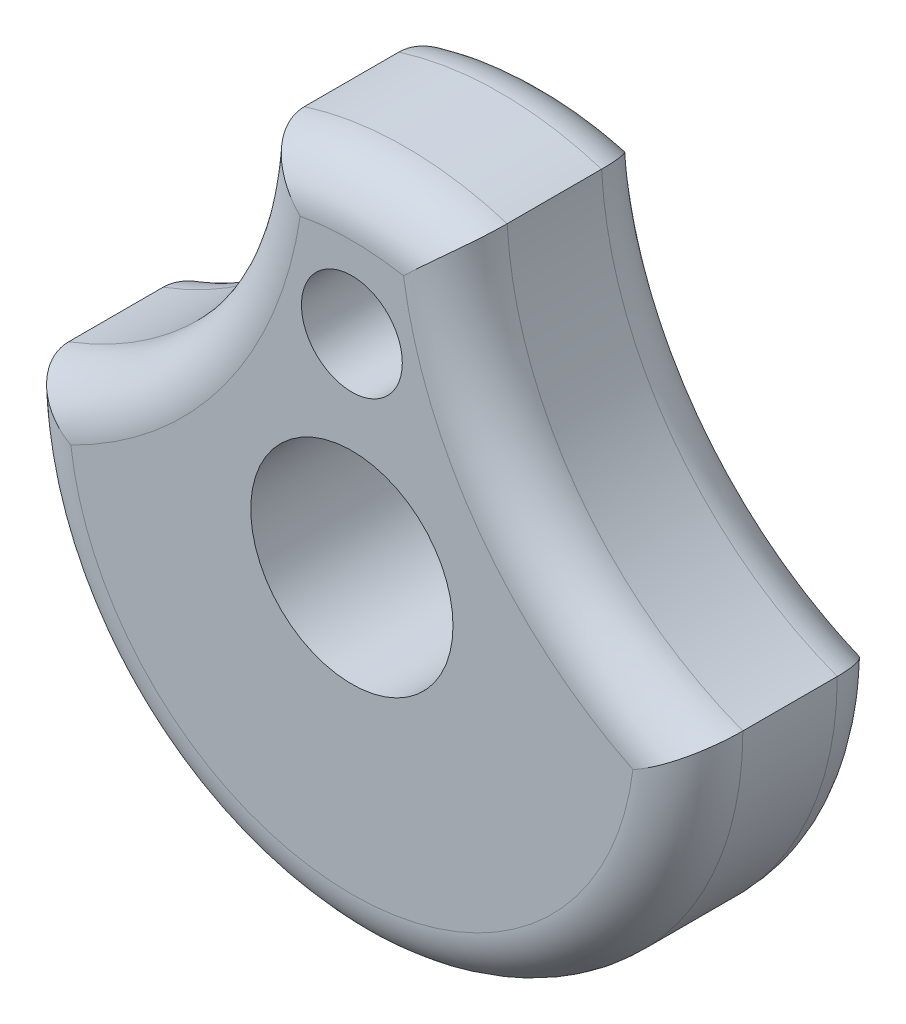
ISO-10303-21;
HEADER;
FILE_DESCRIPTION(('STEP AP214'),'2;1');
FILE_NAME('part.step','',(''),(''),'','','');
FILE_SCHEMA(('AUTOMOTIVE_DESIGN { 1 0 10303 214 1 1 1 1 }'));
ENDSEC;
DATA;
#1=APPLICATION_CONTEXT('core data for automotive mechanical design processes');
#2=APPLICATION_PROTOCOL_DEFINITION('international standard','automotive_design',2000,#1);
#3=PRODUCT_CONTEXT('',#1,'mechanical');
#4=PRODUCT('Part','Part','',(#3));
#5=PRODUCT_RELATED_PRODUCT_CATEGORY('part','',(#4));
#6=PRODUCT_DEFINITION_FORMATION('','',#4);
#7=PRODUCT_DEFINITION_CONTEXT('part definition',#1,'design');
#8=PRODUCT_DEFINITION('design','',#6,#7);
#9=PRODUCT_DEFINITION_SHAPE('','',#8);
#10=(LENGTH_UNIT() NAMED_UNIT(*) SI_UNIT(.MILLI.,.METRE.));
#11=(NAMED_UNIT(*) PLANE_ANGLE_UNIT() SI_UNIT($,.RADIAN.));
#12=(NAMED_UNIT(*) SI_UNIT($,.STERADIAN.) SOLID_ANGLE_UNIT());
#13=UNCERTAINTY_MEASURE_WITH_UNIT(LENGTH_MEASURE(1.E-05),#10,'distance_accuracy_value','');
#14=(GEOMETRIC_REPRESENTATION_CONTEXT(3) GLOBAL_UNCERTAINTY_ASSIGNED_CONTEXT((#13)) GLOBAL_UNIT_ASSIGNED_CONTEXT((#10,
#11,#12)) REPRESENTATION_CONTEXT('',''));
#15=CARTESIAN_POINT('',(0.,0.,0.));
#16=DIRECTION('',(0.,0.,1.));
#17=DIRECTION('',(1.,0.,0.));
#18=AXIS2_PLACEMENT_3D('',#15,#16,#17);
#19=CARTESIAN_POINT('',(0.,0.,-9.525));
#20=DIRECTION('',(0.,0.,1.));
#21=DIRECTION('',(1.,0.,0.));
#22=AXIS2_PLACEMENT_3D('',#19,#20,#21);
#23=CYLINDRICAL_SURFACE('',#22,15.875);
#24=DIRECTION('',(0.,0.,1.));
#25=VECTOR('',#24,1.);
#26=CARTESIAN_POINT('',(-15.875,0.,-9.525));
#27=LINE('',#26,#25);
#28=CARTESIAN_POINT('',(-15.875,0.,-6.985));
#29=VERTEX_POINT('',#28);
#30=CARTESIAN_POINT('',(-15.875,0.,-2.54));
#31=VERTEX_POINT('',#30);
#32=EDGE_CURVE('E280',#29,#31,#27,.T.);
#33=ORIENTED_EDGE('',*,*,#32,.F.);
#34=CARTESIAN_POINT('',(0.,0.,-6.985));
#35=DIRECTION('',(0.,0.,1.));
#36=DIRECTION('',(1.,0.,0.));
#37=AXIS2_PLACEMENT_3D('',#34,#35,#36);
#38=CIRCLE('',#37,15.875);
#39=CARTESIAN_POINT('',(15.875,0.,-6.985));
#40=VERTEX_POINT('',#39);
#41=EDGE_CURVE('E57',#29,#40,#38,.T.);
#42=ORIENTED_EDGE('',*,*,#41,.T.);
#43=DIRECTION('',(0.,0.,1.));
#44=VECTOR('',#43,1.);
#45=CARTESIAN_POINT('',(15.875,0.,-9.525));
#46=LINE('',#45,#44);
#47=CARTESIAN_POINT('',(15.875,0.,-2.54));
#48=VERTEX_POINT('',#47);
#49=EDGE_CURVE('E114',#40,#48,#46,.T.);
#50=ORIENTED_EDGE('',*,*,#49,.T.);
#51=CARTESIAN_POINT('',(0.,0.,-2.54));
#52=DIRECTION('',(0.,0.,1.));
#53=DIRECTION('',(1.,0.,0.));
#54=AXIS2_PLACEMENT_3D('',#51,#52,#53);
#55=CIRCLE('',#54,15.875);
#56=EDGE_CURVE('E117',#48,#31,#55,.F.);
#57=ORIENTED_EDGE('',*,*,#56,.T.);
#58=EDGE_LOOP('',(#33,#42,#50,#57));
#59=FACE_BOUND('',#58,.T.);
#60=ADVANCED_FACE('F42',(#59),#23,.T.);
#61=DIRECTION('',(0.,0.,1.));
#62=VECTOR('',#61,1.);
#63=CARTESIAN_POINT('',(4.7752,15.1397850037575,-9.525));
#64=LINE('',#63,#62);
#65=CARTESIAN_POINT('',(4.7752,15.1397850037575,-6.985));
#66=VERTEX_POINT('',#65);
#67=CARTESIAN_POINT('',(4.7752,15.1397850037575,-2.54));
#68=VERTEX_POINT('',#67);
#69=EDGE_CURVE('E125',#66,#68,#64,.T.);
#70=ORIENTED_EDGE('',*,*,#69,.F.);
#71=CARTESIAN_POINT('',(0.,0.,-6.985));
#72=DIRECTION('',(0.,0.,1.));
#73=DIRECTION('',(1.,0.,0.));
#74=AXIS2_PLACEMENT_3D('',#71,#72,#73);
#75=CIRCLE('',#74,15.875);
#76=CARTESIAN_POINT('',(-4.7752,15.1397850037575,-6.985));
#77=VERTEX_POINT('',#76);
#78=EDGE_CURVE('E71',#66,#77,#75,.T.);
#79=ORIENTED_EDGE('',*,*,#78,.T.);
#80=DIRECTION('',(0.,0.,1.));
#81=VECTOR('',#80,1.);
#82=CARTESIAN_POINT('',(-4.7752,15.1397850037575,-9.525));
#83=LINE('',#82,#81);
#84=CARTESIAN_POINT('',(-4.7752,15.1397850037575,-2.54));
#85=VERTEX_POINT('',#84);
#86=EDGE_CURVE('E283',#77,#85,#83,.T.);
#87=ORIENTED_EDGE('',*,*,#86,.T.);
#88=CARTESIAN_POINT('',(0.,0.,-2.54));
#89=DIRECTION('',(0.,0.,1.));
#90=DIRECTION('',(1.,0.,0.));
#91=AXIS2_PLACEMENT_3D('',#88,#89,#90);
#92=CIRCLE('',#91,15.875);
#93=EDGE_CURVE('E147',#85,#68,#92,.F.);
#94=ORIENTED_EDGE('',*,*,#93,.T.);
#95=EDGE_LOOP('',(#70,#79,#87,#94));
#96=FACE_BOUND('',#95,.T.);
#97=ADVANCED_FACE('F276',(#96),#23,.T.);
#98=CARTESIAN_POINT('',(0.,0.,-9.525));
#99=DIRECTION('',(0.,0.,1.));
#100=DIRECTION('',(1.,0.,0.));
#101=AXIS2_PLACEMENT_3D('',#98,#99,#100);
#102=PLANE('',#101);
#103=CARTESIAN_POINT('',(0.,0.,-9.525));
#104=DIRECTION('',(0.,0.,1.));
#105=DIRECTION('',(1.,0.,0.));
#106=AXIS2_PLACEMENT_3D('',#103,#104,#105);
#107=CIRCLE('',#106,13.335);
#108=CARTESIAN_POINT('',(-2.43189825374815,13.1113727688376,-9.525));
#109=VERTEX_POINT('',#108);
#110=CARTESIAN_POINT('',(2.43189825374815,13.1113727688376,-9.525));
#111=VERTEX_POINT('',#110);
#112=EDGE_CURVE('E221',#109,#111,#107,.F.);
#113=ORIENTED_EDGE('',*,*,#112,.T.);
#114=CARTESIAN_POINT('',(21.8958594465532,16.0530457086763,-9.525));
#115=DIRECTION('',(0.,0.,1.));
#116=DIRECTION('',(1.,0.,0.));
#117=AXIS2_PLACEMENT_3D('',#114,#115,#116);
#118=CIRCLE('',#117,19.685);
#119=CARTESIAN_POINT('',(13.2356639600391,-1.62463058475547,-9.525));
#120=VERTEX_POINT('',#119);
#121=EDGE_CURVE('E224',#111,#120,#118,.T.);
#122=ORIENTED_EDGE('',*,*,#121,.T.);
#123=CARTESIAN_POINT('',(0.,0.,-9.525));
#124=DIRECTION('',(0.,0.,1.));
#125=DIRECTION('',(1.,0.,0.));
#126=AXIS2_PLACEMENT_3D('',#123,#124,#125);
#127=CIRCLE('',#126,13.335);
#128=CARTESIAN_POINT('',(-13.2356639600391,-1.62463058475547,-9.525));
#129=VERTEX_POINT('',#128);
#130=EDGE_CURVE('E218',#120,#129,#127,.F.);
#131=ORIENTED_EDGE('',*,*,#130,.T.);
#132=CARTESIAN_POINT('',(-21.8958594465532,16.0530457086763,-9.525));
#133=DIRECTION('',(0.,0.,1.));
#134=DIRECTION('',(1.,0.,0.));
#135=AXIS2_PLACEMENT_3D('',#132,#133,#134);
#136=CIRCLE('',#135,19.685);
#137=EDGE_CURVE('E176',#129,#109,#136,.T.);
#138=ORIENTED_EDGE('',*,*,#137,.T.);
#139=EDGE_LOOP('',(#113,#122,#131,#138));
#140=FACE_BOUND('',#139,.T.);
#141=CARTESIAN_POINT('',(0.,9.525,-9.525));
#142=DIRECTION('',(0.,0.,1.));
#143=DIRECTION('',(1.,0.,0.));
#144=AXIS2_PLACEMENT_3D('',#141,#142,#143);
#145=CIRCLE('',#144,2.3749);
#146=CARTESIAN_POINT('',(2.3749,9.525,-9.525));
#147=VERTEX_POINT('',#146);
#148=EDGE_CURVE('E287',#147,#147,#145,.T.);
#149=ORIENTED_EDGE('',*,*,#148,.T.);
#150=EDGE_LOOP('',(#149));
#151=FACE_BOUND('',#150,.T.);
#152=CARTESIAN_POINT('',(0.,0.,-9.525));
#153=DIRECTION('',(0.,0.,1.));
#154=DIRECTION('',(1.,0.,0.));
#155=AXIS2_PLACEMENT_3D('',#152,#153,#154);
#156=CIRCLE('',#155,4.7625);
#157=CARTESIAN_POINT('',(4.7625,0.,-9.525));
#158=VERTEX_POINT('',#157);
#159=EDGE_CURVE('E153',#158,#158,#156,.T.);
#160=ORIENTED_EDGE('',*,*,#159,.T.);
#161=EDGE_LOOP('',(#160));
#162=FACE_BOUND('',#161,.T.);
#163=ADVANCED_FACE('F309',(#140,#151,#162),#102,.F.);
#164=CARTESIAN_POINT('',(0.,0.,0.));
#165=DIRECTION('',(0.,0.,1.));
#166=DIRECTION('',(1.,0.,0.));
#167=AXIS2_PLACEMENT_3D('',#164,#165,#166);
#168=PLANE('',#167);
#169=CARTESIAN_POINT('',(0.,0.,0.));
#170=DIRECTION('',(0.,0.,1.));
#171=DIRECTION('',(1.,0.,0.));
#172=AXIS2_PLACEMENT_3D('',#169,#170,#171);
#173=CIRCLE('',#172,13.335);
#174=CARTESIAN_POINT('',(-13.2356639600391,-1.62463058475547,0.));
#175=VERTEX_POINT('',#174);
#176=CARTESIAN_POINT('',(13.2356639600391,-1.62463058475547,0.));
#177=VERTEX_POINT('',#176);
#178=EDGE_CURVE('E166',#175,#177,#173,.T.);
#179=ORIENTED_EDGE('',*,*,#178,.T.);
#180=CARTESIAN_POINT('',(21.8958594465532,16.0530457086763,0.));
#181=DIRECTION('',(0.,0.,1.));
#182=DIRECTION('',(1.,0.,0.));
#183=AXIS2_PLACEMENT_3D('',#180,#181,#182);
#184=CIRCLE('',#183,19.685);
#185=CARTESIAN_POINT('',(2.43189825374815,13.1113727688376,0.));
#186=VERTEX_POINT('',#185);
#187=EDGE_CURVE('E136',#177,#186,#184,.F.);
#188=ORIENTED_EDGE('',*,*,#187,.T.);
#189=CARTESIAN_POINT('',(0.,0.,0.));
#190=DIRECTION('',(0.,0.,1.));
#191=DIRECTION('',(1.,0.,0.));
#192=AXIS2_PLACEMENT_3D('',#189,#190,#191);
#193=CIRCLE('',#192,13.335);
#194=CARTESIAN_POINT('',(-2.43189825374815,13.1113727688376,0.));
#195=VERTEX_POINT('',#194);
#196=EDGE_CURVE('E157',#186,#195,#193,.T.);
#197=ORIENTED_EDGE('',*,*,#196,.T.);
#198=CARTESIAN_POINT('',(-21.8958594465532,16.0530457086763,0.));
#199=DIRECTION('',(0.,0.,1.));
#200=DIRECTION('',(1.,0.,0.));
#201=AXIS2_PLACEMENT_3D('',#198,#199,#200);
#202=CIRCLE('',#201,19.685);
#203=EDGE_CURVE('E152',#195,#175,#202,.F.);
#204=ORIENTED_EDGE('',*,*,#203,.T.);
#205=EDGE_LOOP('',(#179,#188,#197,#204));
#206=FACE_BOUND('',#205,.T.);
#207=CARTESIAN_POINT('',(0.,9.525,0.));
#208=DIRECTION('',(0.,0.,1.));
#209=DIRECTION('',(1.,0.,0.));
#210=AXIS2_PLACEMENT_3D('',#207,#208,#209);
#211=CIRCLE('',#210,2.3749);
#212=CARTESIAN_POINT('',(2.3749,9.525,0.));
#213=VERTEX_POINT('',#212);
#214=EDGE_CURVE('E291',#213,#213,#211,.T.);
#215=ORIENTED_EDGE('',*,*,#214,.F.);
#216=EDGE_LOOP('',(#215));
#217=FACE_BOUND('',#216,.T.);
#218=CARTESIAN_POINT('',(0.,0.,0.));
#219=DIRECTION('',(0.,0.,1.));
#220=DIRECTION('',(1.,0.,0.));
#221=AXIS2_PLACEMENT_3D('',#218,#219,#220);
#222=CIRCLE('',#221,4.7625);
#223=CARTESIAN_POINT('',(4.7625,0.,0.));
#224=VERTEX_POINT('',#223);
#225=EDGE_CURVE('E160',#224,#224,#222,.T.);
#226=ORIENTED_EDGE('',*,*,#225,.F.);
#227=EDGE_LOOP('',(#226));
#228=FACE_BOUND('',#227,.T.);
#229=ADVANCED_FACE('F305',(#206,#217,#228),#168,.T.);
#230=CARTESIAN_POINT('',(0.,0.,-9.525));
#231=DIRECTION('',(0.,0.,1.));
#232=DIRECTION('',(1.,0.,0.));
#233=AXIS2_PLACEMENT_3D('',#230,#231,#232);
#234=CYLINDRICAL_SURFACE('',#233,4.7625);
#235=ORIENTED_EDGE('',*,*,#159,.F.);
#236=EDGE_LOOP('',(#235));
#237=FACE_BOUND('',#236,.T.);
#238=ORIENTED_EDGE('',*,*,#225,.T.);
#239=EDGE_LOOP('',(#238));
#240=FACE_BOUND('',#239,.T.);
#241=ADVANCED_FACE('F308',(#237,#240),#234,.F.);
#242=CARTESIAN_POINT('',(0.,9.525,-9.525));
#243=DIRECTION('',(0.,0.,1.));
#244=DIRECTION('',(1.,0.,0.));
#245=AXIS2_PLACEMENT_3D('',#242,#243,#244);
#246=CYLINDRICAL_SURFACE('',#245,2.3749);
#247=ORIENTED_EDGE('',*,*,#148,.F.);
#248=EDGE_LOOP('',(#247));
#249=FACE_BOUND('',#248,.T.);
#250=ORIENTED_EDGE('',*,*,#214,.T.);
#251=EDGE_LOOP('',(#250));
#252=FACE_BOUND('',#251,.T.);
#253=ADVANCED_FACE('F317',(#249,#252),#246,.F.);
#254=CARTESIAN_POINT('',(21.8958594465532,16.0530457086763,-9.525));
#255=DIRECTION('',(0.,0.,1.));
#256=DIRECTION('',(1.,0.,0.));
#257=AXIS2_PLACEMENT_3D('',#254,#255,#256);
#258=CYLINDRICAL_SURFACE('',#257,17.145);
#259=ORIENTED_EDGE('',*,*,#49,.F.);
#260=CARTESIAN_POINT('',(21.8958594465532,16.0530457086763,-6.985));
#261=DIRECTION('',(0.,0.,1.));
#262=DIRECTION('',(1.,0.,0.));
#263=AXIS2_PLACEMENT_3D('',#260,#261,#262);
#264=CIRCLE('',#263,17.145);
#265=EDGE_CURVE('E228',#40,#66,#264,.F.);
#266=ORIENTED_EDGE('',*,*,#265,.T.);
#267=ORIENTED_EDGE('',*,*,#69,.T.);
#268=CARTESIAN_POINT('',(21.8958594465532,16.0530457086763,-2.54));
#269=DIRECTION('',(0.,0.,1.));
#270=DIRECTION('',(1.,0.,0.));
#271=AXIS2_PLACEMENT_3D('',#268,#269,#270);
#272=CIRCLE('',#271,17.145);
#273=EDGE_CURVE('E134',#68,#48,#272,.T.);
#274=ORIENTED_EDGE('',*,*,#273,.T.);
#275=EDGE_LOOP('',(#259,#266,#267,#274));
#276=FACE_BOUND('',#275,.T.);
#277=ADVANCED_FACE('F149',(#276),#258,.F.);
#278=CARTESIAN_POINT('',(-21.8958594465532,16.0530457086763,-9.525));
#279=DIRECTION('',(0.,0.,1.));
#280=DIRECTION('',(1.,0.,0.));
#281=AXIS2_PLACEMENT_3D('',#278,#279,#280);
#282=CYLINDRICAL_SURFACE('',#281,17.145);
#283=ORIENTED_EDGE('',*,*,#86,.F.);
#284=CARTESIAN_POINT('',(-21.8958594465532,16.0530457086763,-6.985));
#285=DIRECTION('',(0.,0.,1.));
#286=DIRECTION('',(1.,0.,0.));
#287=AXIS2_PLACEMENT_3D('',#284,#285,#286);
#288=CIRCLE('',#287,17.145);
#289=EDGE_CURVE('E11',#77,#29,#288,.F.);
#290=ORIENTED_EDGE('',*,*,#289,.T.);
#291=ORIENTED_EDGE('',*,*,#32,.T.);
#292=CARTESIAN_POINT('',(-21.8958594465532,16.0530457086763,-2.54));
#293=DIRECTION('',(0.,0.,1.));
#294=DIRECTION('',(1.,0.,0.));
#295=AXIS2_PLACEMENT_3D('',#292,#293,#294);
#296=CIRCLE('',#295,17.145);
#297=EDGE_CURVE('E173',#31,#85,#296,.T.);
#298=ORIENTED_EDGE('',*,*,#297,.T.);
#299=EDGE_LOOP('',(#283,#290,#291,#298));
#300=FACE_BOUND('',#299,.T.);
#301=ADVANCED_FACE('F298',(#300),#282,.F.);
#302=CARTESIAN_POINT('',(-21.8958594465532,16.0530457086763,-2.54));
#303=DIRECTION('',(0.,0.,1.));
#304=DIRECTION('',(1.,0.,0.));
#305=AXIS2_PLACEMENT_3D('',#302,#303,#304);
#306=TOROIDAL_SURFACE('',#305,19.685,2.54);
#307=CARTESIAN_POINT('',(-15.875,0.,-2.54));
#308=CARTESIAN_POINT('',(-15.875011035577,9.67959000808573E-06,-2.47759961717362));
#309=CARTESIAN_POINT('',(-15.8727008346527,-0.00159318558438933,-2.41520663359023));
#310=CARTESIAN_POINT('',(-15.8635228750597,-0.00795030003033197,-2.2909447341386));
#311=CARTESIAN_POINT('',(-15.8566570949852,-0.0127031811754103,-2.22907560255861));
#312=CARTESIAN_POINT('',(-15.8385007064541,-0.0252535953934955,-2.10663901437687));
#313=CARTESIAN_POINT('',(-15.8272335980759,-0.0330349576523916,-2.04606641759837));
#314=CARTESIAN_POINT('',(-15.8004381508091,-0.0515014095663261,-1.92633680777353));
#315=CARTESIAN_POINT('',(-15.7849095385524,-0.0621866855020355,-1.86717988580507));
#316=CARTESIAN_POINT('',(-15.7322577345783,-0.0983216521184355,-1.69260133535844));
#317=CARTESIAN_POINT('',(-15.6890259649945,-0.127880232507952,-1.5797916344026));
#318=CARTESIAN_POINT('',(-15.5882204997024,-0.196264861280495,-1.36380940125554));
#319=CARTESIAN_POINT('',(-15.5306305497572,-0.235101410729569,-1.26064797469283));
#320=CARTESIAN_POINT('',(-15.3991471421842,-0.322927609033043,-1.05930839542953));
#321=CARTESIAN_POINT('',(-15.3244439601645,-0.372409251009303,-0.961876190769851));
#322=CARTESIAN_POINT('',(-15.1636978435424,-0.477639380240903,-0.780822697685214));
#323=CARTESIAN_POINT('',(-15.0776521215094,-0.533389407455929,-0.697204815550572));
#324=CARTESIAN_POINT('',(-14.8812137302948,-0.659010288492005,-0.531358188800642));
#325=CARTESIAN_POINT('',(-14.7691572702479,-0.729682038155604,-0.451709457340281));
#326=CARTESIAN_POINT('',(-14.5355306996401,-0.87456949576647,-0.311847428051249));
#327=CARTESIAN_POINT('',(-14.4139501545962,-0.948789054964353,-0.251655827929376));
#328=CARTESIAN_POINT('',(-14.1418783286326,-1.11191316952271,-0.141661073413214));
#329=CARTESIAN_POINT('',(-13.9900657786484,-1.20110248357548,-0.0955529204188953));
#330=CARTESIAN_POINT('',(-13.6807515386827,-1.37876922311312,-0.0296357961396635));
#331=CARTESIAN_POINT('',(-13.5232594944408,-1.46724756990187,-0.00978421040848305));
#332=CARTESIAN_POINT('',(-13.3247587879194,-1.57618451291468,-0.00107266417256496));
#333=CARTESIAN_POINT('',(-13.2847983165469,-1.59798530516189,-0.000137359961281783));
#334=CARTESIAN_POINT('',(-13.2417415733669,-1.62133667929731,-4.68443420540658E-06));
#335=CARTESIAN_POINT('',(-13.2387029309582,-1.62298391364793,-2.68338397828118E-09));
#336=CARTESIAN_POINT('',(-13.2356639600391,-1.62463058475547,0.));
#337=B_SPLINE_CURVE_WITH_KNOTS('',3,(#307,#308,#309,#310,#311,#312,#313,#314,#315,#316,#317,
#318,#319,#320,#321,#322,#323,#324,#325,#326,#327,#328,#329,#330,#331,#332,#333,#334,#335,#336),
.UNSPECIFIED.,.F.,.F.,(4,2,2,2,2,2,2,2,2,2,2,2,2,2,4),(0.,0.187125568695754,0.37416991754331,
0.560228935700912,0.746299892017461,1.11759763487979,1.48931763074456,1.88491892191536,
2.28061761403286,2.74261371341686,3.20512324659667,3.74906579854985,4.29212444322518,
4.42870036816248,4.43906958340971),.UNSPECIFIED.);
#338=EDGE_CURVE('E145',#175,#31,#337,.F.);
#339=ORIENTED_EDGE('',*,*,#338,.F.);
#340=ORIENTED_EDGE('',*,*,#203,.F.);
#341=CARTESIAN_POINT('',(-4.7752,15.1397850037575,-2.54));
#342=CARTESIAN_POINT('',(-4.77521255080308,15.1397926166258,-2.47759961717362));
#343=CARTESIAN_POINT('',(-4.77298901029386,15.138071549317,-2.41520663359022));
#344=CARTESIAN_POINT('',(-4.76416558109042,15.1312308663494,-2.2909447341386));
#345=CARTESIAN_POINT('',(-4.75756759232214,15.1261127261185,-2.22907560255861));
#346=CARTESIAN_POINT('',(-4.74013698070111,15.11257237457,-2.10663901437687));
#347=CARTESIAN_POINT('',(-4.72932684857112,15.1041677107967,-2.04606641759837));
#348=CARTESIAN_POINT('',(-4.7036555583949,15.084167943268,-1.92633680777353));
#349=CARTESIAN_POINT('',(-4.68879414046602,15.072572634838,-1.86717988580507));
#350=CARTESIAN_POINT('',(-4.63849502109423,15.0332286789551,-1.69260133535844));
#351=CARTESIAN_POINT('',(-4.59730126372541,15.0008903127343,-1.57979163440259));
#352=CARTESIAN_POINT('',(-4.50176143159684,14.9253235226611,-1.36380940125554));
#353=CARTESIAN_POINT('',(-4.44740045282992,14.8820827560711,-1.26064797469283));
#354=CARTESIAN_POINT('',(-4.32409151879181,14.7831068278771,-1.05930839542953));
#355=CARTESIAN_POINT('',(-4.25443079085896,14.7267474339804,-0.961876190769847));
#356=CARTESIAN_POINT('',(-4.10572172701156,14.6050991358551,-0.780822697685209));
#357=CARTESIAN_POINT('',(-4.02667108399794,14.5398080365092,-0.697204815550568));
#358=CARTESIAN_POINT('',(-3.84777938405484,14.3902540095266,-0.531358188800642));
#359=CARTESIAN_POINT('',(-3.74667405468401,14.3046452552338,-0.451709457340283));
#360=CARTESIAN_POINT('',(-3.5382218620581,14.1254207221576,-0.311847428051252));
#361=CARTESIAN_POINT('',(-3.43086818722196,14.0317961505972,-0.251655827929378));
#362=CARTESIAN_POINT('',(-3.19345959467506,13.8213924542929,-0.141661073413211));
#363=CARTESIAN_POINT('',(-3.06273566849717,13.7034389075105,-0.0955529204188897));
#364=CARTESIAN_POINT('',(-2.80025544187617,13.4618920176184,-0.0296357961396598));
#365=CARTESIAN_POINT('',(-2.66850116423579,13.3383081506559,-0.00978421040848159));
#366=CARTESIAN_POINT('',(-2.50490037872723,13.1817687913131,-0.00107266417256461));
#367=CARTESIAN_POINT('',(-2.47208913145616,13.1502166777954,-0.000137359961281559));
#368=CARTESIAN_POINT('',(-2.43686775545669,13.1161781043824,-4.68443420537858E-06));
#369=CARTESIAN_POINT('',(-2.43438278543154,13.1137756779699,-2.68338396431635E-09));
#370=CARTESIAN_POINT('',(-2.43189825374815,13.1113727688376,0.));
#371=B_SPLINE_CURVE_WITH_KNOTS('',3,(#341,#342,#343,#344,#345,#346,#347,#348,#349,#350,#351,
#352,#353,#354,#355,#356,#357,#358,#359,#360,#361,#362,#363,#364,#365,#366,#367,#368,#369,#370),
.UNSPECIFIED.,.F.,.F.,(4,2,2,2,2,2,2,2,2,2,2,2,2,2,4),(0.,0.187125568695756,0.374169917543312,
0.560228935700912,0.746299892017463,1.11759763487979,1.48931763074456,1.88491892191536,
2.28061761403287,2.74261371341686,3.20512324659667,3.74906579854988,4.29212444322519,
4.42870036816248,4.43906958340971),.UNSPECIFIED.);
#372=EDGE_CURVE('E126',#85,#195,#371,.T.);
#373=ORIENTED_EDGE('',*,*,#372,.F.);
#374=ORIENTED_EDGE('',*,*,#297,.F.);
#375=EDGE_LOOP('',(#339,#340,#373,#374));
#376=FACE_BOUND('',#375,.T.);
#377=ADVANCED_FACE('F199',(#376),#306,.T.);
#378=CARTESIAN_POINT('',(0.,0.,-2.54));
#379=DIRECTION('',(0.,0.,1.));
#380=DIRECTION('',(1.,0.,0.));
#381=AXIS2_PLACEMENT_3D('',#378,#379,#380);
#382=TOROIDAL_SURFACE('',#381,13.335,2.54);
#383=ORIENTED_EDGE('',*,*,#372,.T.);
#384=ORIENTED_EDGE('',*,*,#196,.F.);
#385=CARTESIAN_POINT('',(4.7752,15.1397850037575,-2.54));
#386=CARTESIAN_POINT('',(4.77521255080308,15.1397926166258,-2.47759961717362));
#387=CARTESIAN_POINT('',(4.77298901029386,15.138071549317,-2.41520663359022));
#388=CARTESIAN_POINT('',(4.76416558109043,15.1312308663494,-2.2909447341386));
#389=CARTESIAN_POINT('',(4.75756759232214,15.1261127261185,-2.22907560255861));
#390=CARTESIAN_POINT('',(4.74013698070111,15.11257237457,-2.10663901437686));
#391=CARTESIAN_POINT('',(4.72932684857112,15.1041677107967,-2.04606641759837));
#392=CARTESIAN_POINT('',(4.7036555583949,15.084167943268,-1.92633680777353));
#393=CARTESIAN_POINT('',(4.68879414046602,15.072572634838,-1.86717988580506));
#394=CARTESIAN_POINT('',(4.63849502109423,15.0332286789551,-1.69260133535844));
#395=CARTESIAN_POINT('',(4.59730126372541,15.0008903127343,-1.57979163440259));
#396=CARTESIAN_POINT('',(4.50176143159684,14.9253235226611,-1.36380940125554));
#397=CARTESIAN_POINT('',(4.44740045282992,14.8820827560711,-1.26064797469283));
#398=CARTESIAN_POINT('',(4.32409151879181,14.7831068278771,-1.05930839542953));
#399=CARTESIAN_POINT('',(4.25443079085896,14.7267474339804,-0.961876190769847));
#400=CARTESIAN_POINT('',(4.10572172701156,14.6050991358551,-0.780822697685209));
#401=CARTESIAN_POINT('',(4.02667108399794,14.5398080365092,-0.697204815550568));
#402=CARTESIAN_POINT('',(3.84777938405484,14.3902540095266,-0.531358188800642));
#403=CARTESIAN_POINT('',(3.74667405468401,14.3046452552338,-0.451709457340283));
#404=CARTESIAN_POINT('',(3.53822186205811,14.1254207221576,-0.311847428051252));
#405=CARTESIAN_POINT('',(3.43086818722196,14.0317961505972,-0.251655827929377));
#406=CARTESIAN_POINT('',(3.19345959467506,13.8213924542929,-0.141661073413211));
#407=CARTESIAN_POINT('',(3.06273566849717,13.7034389075105,-0.09555292041889));
#408=CARTESIAN_POINT('',(2.80025544187617,13.4618920176184,-0.0296357961396602));
#409=CARTESIAN_POINT('',(2.66850116423578,13.3383081506559,-0.00978421040848164));
#410=CARTESIAN_POINT('',(2.50490037872723,13.1817687913131,-0.00107266417256459));
#411=CARTESIAN_POINT('',(2.47208913145616,13.1502166777954,-0.000137359961281542));
#412=CARTESIAN_POINT('',(2.43686775545669,13.1161781043824,-4.68443420537653E-06));
#413=CARTESIAN_POINT('',(2.43438278543154,13.1137756779699,-2.68338396339708E-09));
#414=CARTESIAN_POINT('',(2.43189825374815,13.1113727688376,0.));
#415=B_SPLINE_CURVE_WITH_KNOTS('',3,(#385,#386,#387,#388,#389,#390,#391,#392,#393,#394,#395,
#396,#397,#398,#399,#400,#401,#402,#403,#404,#405,#406,#407,#408,#409,#410,#411,#412,#413,#414),
.UNSPECIFIED.,.F.,.F.,(4,2,2,2,2,2,2,2,2,2,2,2,2,2,4),(0.,0.187125568695756,0.374169917543312,
0.560228935700913,0.746299892017463,1.11759763487979,1.48931763074456,1.88491892191536,
2.28061761403287,2.74261371341686,3.20512324659667,3.74906579854988,4.29212444322519,
4.42870036816248,4.43906958340971),.UNSPECIFIED.);
#416=EDGE_CURVE('E140',#68,#186,#415,.T.);
#417=ORIENTED_EDGE('',*,*,#416,.F.);
#418=ORIENTED_EDGE('',*,*,#93,.F.);
#419=EDGE_LOOP('',(#383,#384,#417,#418));
#420=FACE_BOUND('',#419,.T.);
#421=ADVANCED_FACE('F194',(#420),#382,.T.);
#422=CARTESIAN_POINT('',(0.,0.,-2.54));
#423=DIRECTION('',(0.,0.,1.));
#424=DIRECTION('',(1.,0.,0.));
#425=AXIS2_PLACEMENT_3D('',#422,#423,#424);
#426=TOROIDAL_SURFACE('',#425,13.335,2.54);
#427=ORIENTED_EDGE('',*,*,#338,.T.);
#428=ORIENTED_EDGE('',*,*,#56,.F.);
#429=CARTESIAN_POINT('',(15.875,0.,-2.54));
#430=CARTESIAN_POINT('',(15.875011035577,9.67959000807967E-06,-2.47759961717362));
#431=CARTESIAN_POINT('',(15.8727008346527,-0.00159318558438935,-2.41520663359023));
#432=CARTESIAN_POINT('',(15.8635228750597,-0.00795030003033199,-2.2909447341386));
#433=CARTESIAN_POINT('',(15.8566570949852,-0.0127031811754104,-2.22907560255861));
#434=CARTESIAN_POINT('',(15.8385007064541,-0.0252535953934955,-2.10663901437687));
#435=CARTESIAN_POINT('',(15.8272335980759,-0.0330349576523916,-2.04606641759837));
#436=CARTESIAN_POINT('',(15.8004381508091,-0.0515014095663261,-1.92633680777353));
#437=CARTESIAN_POINT('',(15.7849095385524,-0.0621866855020355,-1.86717988580507));
#438=CARTESIAN_POINT('',(15.7322577345783,-0.0983216521184355,-1.69260133535844));
#439=CARTESIAN_POINT('',(15.6890259649945,-0.127880232507952,-1.5797916344026));
#440=CARTESIAN_POINT('',(15.5882204997024,-0.196264861280495,-1.36380940125554));
#441=CARTESIAN_POINT('',(15.5306305497572,-0.235101410729569,-1.26064797469283));
#442=CARTESIAN_POINT('',(15.3991471421842,-0.322927609033043,-1.05930839542953));
#443=CARTESIAN_POINT('',(15.3244439601645,-0.372409251009303,-0.961876190769851));
#444=CARTESIAN_POINT('',(15.1636978435424,-0.477639380240903,-0.780822697685214));
#445=CARTESIAN_POINT('',(15.0776521215094,-0.533389407455929,-0.697204815550572));
#446=CARTESIAN_POINT('',(14.8812137302948,-0.659010288492005,-0.531358188800642));
#447=CARTESIAN_POINT('',(14.7691572702479,-0.729682038155603,-0.451709457340281));
#448=CARTESIAN_POINT('',(14.5355306996401,-0.874569495766469,-0.311847428051249));
#449=CARTESIAN_POINT('',(14.4139501545962,-0.948789054964353,-0.251655827929376));
#450=CARTESIAN_POINT('',(14.1418783286326,-1.11191316952271,-0.141661073413214));
#451=CARTESIAN_POINT('',(13.9900657786484,-1.20110248357548,-0.0955529204188949));
#452=CARTESIAN_POINT('',(13.6807515386827,-1.37876922311312,-0.0296357961396632));
#453=CARTESIAN_POINT('',(13.5232594944408,-1.46724756990187,-0.00978421040848304));
#454=CARTESIAN_POINT('',(13.3247587879194,-1.57618451291468,-0.00107266417256496));
#455=CARTESIAN_POINT('',(13.2847983165469,-1.59798530516189,-0.000137359961281762));
#456=CARTESIAN_POINT('',(13.2417415733669,-1.62133667929731,-4.68443420540346E-06));
#457=CARTESIAN_POINT('',(13.2387029309582,-1.62298391364793,-2.68338397656248E-09));
#458=CARTESIAN_POINT('',(13.2356639600391,-1.62463058475547,0.));
#459=B_SPLINE_CURVE_WITH_KNOTS('',3,(#429,#430,#431,#432,#433,#434,#435,#436,#437,#438,#439,
#440,#441,#442,#443,#444,#445,#446,#447,#448,#449,#450,#451,#452,#453,#454,#455,#456,#457,#458),
.UNSPECIFIED.,.F.,.F.,(4,2,2,2,2,2,2,2,2,2,2,2,2,2,4),(0.,0.187125568695754,0.37416991754331,
0.560228935700912,0.746299892017461,1.11759763487979,1.48931763074456,1.88491892191536,
2.28061761403286,2.74261371341686,3.20512324659667,3.74906579854985,4.29212444322518,
4.42870036816248,4.43906958340971),.UNSPECIFIED.);
#460=EDGE_CURVE('E132',#177,#48,#459,.F.);
#461=ORIENTED_EDGE('',*,*,#460,.F.);
#462=ORIENTED_EDGE('',*,*,#178,.F.);
#463=EDGE_LOOP('',(#427,#428,#461,#462));
#464=FACE_BOUND('',#463,.T.);
#465=ADVANCED_FACE('F143',(#464),#426,.T.);
#466=CARTESIAN_POINT('',(21.8958594465532,16.0530457086763,-2.54));
#467=DIRECTION('',(0.,0.,1.));
#468=DIRECTION('',(1.,0.,0.));
#469=AXIS2_PLACEMENT_3D('',#466,#467,#468);
#470=TOROIDAL_SURFACE('',#469,19.685,2.54);
#471=ORIENTED_EDGE('',*,*,#416,.T.);
#472=ORIENTED_EDGE('',*,*,#187,.F.);
#473=ORIENTED_EDGE('',*,*,#460,.T.);
#474=ORIENTED_EDGE('',*,*,#273,.F.);
#475=EDGE_LOOP('',(#471,#472,#473,#474));
#476=FACE_BOUND('',#475,.T.);
#477=ADVANCED_FACE('F133',(#476),#470,.T.);
#478=CARTESIAN_POINT('',(-21.8958594465532,16.0530457086763,-6.985));
#479=DIRECTION('',(0.,0.,1.));
#480=DIRECTION('',(1.,0.,0.));
#481=AXIS2_PLACEMENT_3D('',#478,#479,#480);
#482=TOROIDAL_SURFACE('',#481,19.685,2.54);
#483=CARTESIAN_POINT('',(-15.875,0.,-6.985));
#484=CARTESIAN_POINT('',(-15.875011035577,9.67959000478082E-06,-7.04740038282638));
#485=CARTESIAN_POINT('',(-15.8727008346527,-0.00159318558439265,-7.10979336640978));
#486=CARTESIAN_POINT('',(-15.8635228750597,-0.00795030003033373,-7.23405526586141));
#487=CARTESIAN_POINT('',(-15.8566570949852,-0.0127031811754105,-7.29592439744139));
#488=CARTESIAN_POINT('',(-15.8385007064541,-0.025253595393496,-7.41836098562314));
#489=CARTESIAN_POINT('',(-15.8272335980759,-0.0330349576523938,-7.47893358240163));
#490=CARTESIAN_POINT('',(-15.8004381508091,-0.0515014095663276,-7.59866319222647));
#491=CARTESIAN_POINT('',(-15.7849095385524,-0.0621866855020346,-7.65782011419494));
#492=CARTESIAN_POINT('',(-15.7322577345783,-0.0983216521184308,-7.83239866464157));
#493=CARTESIAN_POINT('',(-15.6890259649945,-0.12788023250795,-7.94520836559741));
#494=CARTESIAN_POINT('',(-15.5882204997024,-0.196264861280496,-8.16119059874446));
#495=CARTESIAN_POINT('',(-15.5306305497572,-0.235101410729571,-8.26435202530718));
#496=CARTESIAN_POINT('',(-15.3991471421842,-0.322927609033046,-8.46569160457047));
#497=CARTESIAN_POINT('',(-15.3244439601644,-0.372409251009305,-8.56312380923015));
#498=CARTESIAN_POINT('',(-15.1636978435424,-0.477639380240904,-8.74417730231479));
#499=CARTESIAN_POINT('',(-15.0776521215094,-0.53338940745593,-8.82779518444943));
#500=CARTESIAN_POINT('',(-14.8812137302948,-0.659010288492009,-8.99364181119936));
#501=CARTESIAN_POINT('',(-14.7691572702479,-0.729682038155609,-9.07329054265972));
#502=CARTESIAN_POINT('',(-14.5355306996401,-0.87456949576647,-9.21315257194875));
#503=CARTESIAN_POINT('',(-14.4139501545962,-0.948789054964347,-9.27334417207063));
#504=CARTESIAN_POINT('',(-14.1418783286326,-1.11191316952272,-9.38333892658679));
#505=CARTESIAN_POINT('',(-13.9900657786484,-1.2011024835755,-9.4294470795811));
#506=CARTESIAN_POINT('',(-13.6807515386827,-1.3787692231131,-9.49536420386034));
#507=CARTESIAN_POINT('',(-13.5232594944408,-1.46724756990179,-9.51521578959152));
#508=CARTESIAN_POINT('',(-13.3247587879194,-1.57618451291472,-9.52392733582744));
#509=CARTESIAN_POINT('',(-13.284798316547,-1.59798530516196,-9.52486264003871));
#510=CARTESIAN_POINT('',(-13.2417415733669,-1.62133667929732,-9.52499531556579));
#511=CARTESIAN_POINT('',(-13.2387029309582,-1.62298391364794,-9.52499999731662));
#512=CARTESIAN_POINT('',(-13.2356639600391,-1.62463058475547,-9.525));
#513=B_SPLINE_CURVE_WITH_KNOTS('',3,(#483,#484,#485,#486,#487,#488,#489,#490,#491,#492,#493,
#494,#495,#496,#497,#498,#499,#500,#501,#502,#503,#504,#505,#506,#507,#508,#509,#510,#511,#512),
.UNSPECIFIED.,.F.,.F.,(4,2,2,2,2,2,2,2,2,2,2,2,2,2,4),(0.,0.187125568695755,0.374169917543312,
0.560228935700912,0.746299892017461,1.11759763487979,1.48931763074456,1.88491892191536,
2.28061761403286,2.74261371341687,3.20512324659667,3.74906579854985,4.29212444322519,
4.42870036816247,4.43906958340971),.UNSPECIFIED.);
#514=EDGE_CURVE('E257',#29,#129,#513,.T.);
#515=ORIENTED_EDGE('',*,*,#514,.F.);
#516=ORIENTED_EDGE('',*,*,#289,.F.);
#517=CARTESIAN_POINT('',(-4.7752,15.1397850037575,-6.985));
#518=CARTESIAN_POINT('',(-4.77521255080308,15.1397926166258,-7.04740038282638));
#519=CARTESIAN_POINT('',(-4.77298901029386,15.138071549317,-7.10979336640978));
#520=CARTESIAN_POINT('',(-4.76416558109042,15.1312308663494,-7.23405526586141));
#521=CARTESIAN_POINT('',(-4.75756759232214,15.1261127261185,-7.29592439744139));
#522=CARTESIAN_POINT('',(-4.74013698070111,15.11257237457,-7.41836098562314));
#523=CARTESIAN_POINT('',(-4.72932684857112,15.1041677107967,-7.47893358240163));
#524=CARTESIAN_POINT('',(-4.7036555583949,15.084167943268,-7.59866319222647));
#525=CARTESIAN_POINT('',(-4.68879414046603,15.072572634838,-7.65782011419494));
#526=CARTESIAN_POINT('',(-4.63849502109424,15.0332286789551,-7.83239866464157));
#527=CARTESIAN_POINT('',(-4.59730126372541,15.0008903127343,-7.94520836559741));
#528=CARTESIAN_POINT('',(-4.50176143159683,14.9253235226611,-8.16119059874446));
#529=CARTESIAN_POINT('',(-4.44740045282991,14.8820827560711,-8.26435202530718));
#530=CARTESIAN_POINT('',(-4.32409151879181,14.7831068278771,-8.46569160457047));
#531=CARTESIAN_POINT('',(-4.25443079085896,14.7267474339804,-8.56312380923016));
#532=CARTESIAN_POINT('',(-4.10572172701155,14.6050991358551,-8.74417730231479));
#533=CARTESIAN_POINT('',(-4.02667108399794,14.5398080365092,-8.82779518444943));
#534=CARTESIAN_POINT('',(-3.84777938405484,14.3902540095266,-8.99364181119936));
#535=CARTESIAN_POINT('',(-3.74667405468399,14.3046452552338,-9.07329054265972));
#536=CARTESIAN_POINT('',(-3.53822186205811,14.1254207221576,-9.21315257194875));
#537=CARTESIAN_POINT('',(-3.43086818722199,14.0317961505971,-9.27334417207063));
#538=CARTESIAN_POINT('',(-3.19345959467502,13.8213924542929,-9.38333892658679));
#539=CARTESIAN_POINT('',(-3.06273566849701,13.7034389075106,-9.42944707958111));
#540=CARTESIAN_POINT('',(-2.80025544187634,13.4618920176183,-9.49536420386034));
#541=CARTESIAN_POINT('',(-2.66850116423644,13.3383081506553,-9.51521578959152));
#542=CARTESIAN_POINT('',(-2.50490037872706,13.1817687913132,-9.52392733582744));
#543=CARTESIAN_POINT('',(-2.47208913145576,13.1502166777958,-9.52486264003871));
#544=CARTESIAN_POINT('',(-2.43686775545663,13.1161781043825,-9.52499531556579));
#545=CARTESIAN_POINT('',(-2.43438278543151,13.11377567797,-9.52499999731662));
#546=CARTESIAN_POINT('',(-2.43189825374815,13.1113727688376,-9.525));
#547=B_SPLINE_CURVE_WITH_KNOTS('',3,(#517,#518,#519,#520,#521,#522,#523,#524,#525,#526,#527,
#528,#529,#530,#531,#532,#533,#534,#535,#536,#537,#538,#539,#540,#541,#542,#543,#544,#545,#546),
.UNSPECIFIED.,.F.,.F.,(4,2,2,2,2,2,2,2,2,2,2,2,2,2,4),(0.,0.187125568695755,0.374169917543312,
0.560228935700912,0.746299892017463,1.11759763487979,1.48931763074456,1.88491892191536,
2.28061761403286,2.74261371341687,3.20512324659667,3.74906579854986,4.29212444322519,
4.42870036816247,4.43906958340971),.UNSPECIFIED.);
#548=EDGE_CURVE('E47',#109,#77,#547,.F.);
#549=ORIENTED_EDGE('',*,*,#548,.F.);
#550=ORIENTED_EDGE('',*,*,#137,.F.);
#551=EDGE_LOOP('',(#515,#516,#549,#550));
#552=FACE_BOUND('',#551,.T.);
#553=ADVANCED_FACE('F44',(#552),#482,.T.);
#554=CARTESIAN_POINT('',(0.,0.,-6.985));
#555=DIRECTION('',(0.,0.,1.));
#556=DIRECTION('',(1.,0.,0.));
#557=AXIS2_PLACEMENT_3D('',#554,#555,#556);
#558=TOROIDAL_SURFACE('',#557,13.335,2.54);
#559=ORIENTED_EDGE('',*,*,#548,.T.);
#560=ORIENTED_EDGE('',*,*,#78,.F.);
#561=CARTESIAN_POINT('',(4.7752,15.1397850037575,-6.985));
#562=CARTESIAN_POINT('',(4.77521255080308,15.1397926166258,-7.04740038282638));
#563=CARTESIAN_POINT('',(4.77298901029386,15.138071549317,-7.10979336640978));
#564=CARTESIAN_POINT('',(4.76416558109042,15.1312308663494,-7.23405526586141));
#565=CARTESIAN_POINT('',(4.75756759232214,15.1261127261185,-7.29592439744139));
#566=CARTESIAN_POINT('',(4.74013698070111,15.11257237457,-7.41836098562314));
#567=CARTESIAN_POINT('',(4.72932684857112,15.1041677107967,-7.47893358240163));
#568=CARTESIAN_POINT('',(4.7036555583949,15.084167943268,-7.59866319222647));
#569=CARTESIAN_POINT('',(4.68879414046603,15.072572634838,-7.65782011419494));
#570=CARTESIAN_POINT('',(4.63849502109424,15.0332286789551,-7.83239866464157));
#571=CARTESIAN_POINT('',(4.59730126372541,15.0008903127343,-7.94520836559741));
#572=CARTESIAN_POINT('',(4.50176143159683,14.9253235226611,-8.16119059874446));
#573=CARTESIAN_POINT('',(4.44740045282991,14.8820827560711,-8.26435202530718));
#574=CARTESIAN_POINT('',(4.32409151879181,14.7831068278771,-8.46569160457047));
#575=CARTESIAN_POINT('',(4.25443079085896,14.7267474339804,-8.56312380923016));
#576=CARTESIAN_POINT('',(4.10572172701155,14.6050991358551,-8.74417730231479));
#577=CARTESIAN_POINT('',(4.02667108399794,14.5398080365092,-8.82779518444943));
#578=CARTESIAN_POINT('',(3.84777938405484,14.3902540095266,-8.99364181119936));
#579=CARTESIAN_POINT('',(3.74667405468399,14.3046452552338,-9.07329054265972));
#580=CARTESIAN_POINT('',(3.53822186205811,14.1254207221576,-9.21315257194875));
#581=CARTESIAN_POINT('',(3.43086818722199,14.0317961505971,-9.27334417207063));
#582=CARTESIAN_POINT('',(3.19345959467502,13.8213924542929,-9.38333892658679));
#583=CARTESIAN_POINT('',(3.06273566849701,13.7034389075106,-9.42944707958111));
#584=CARTESIAN_POINT('',(2.80025544187634,13.4618920176183,-9.49536420386034));
#585=CARTESIAN_POINT('',(2.66850116423644,13.3383081506553,-9.51521578959152));
#586=CARTESIAN_POINT('',(2.50490037872706,13.1817687913132,-9.52392733582744));
#587=CARTESIAN_POINT('',(2.47208913145576,13.1502166777958,-9.52486264003871));
#588=CARTESIAN_POINT('',(2.43686775545663,13.1161781043825,-9.52499531556579));
#589=CARTESIAN_POINT('',(2.43438278543151,13.11377567797,-9.52499999731662));
#590=CARTESIAN_POINT('',(2.43189825374815,13.1113727688376,-9.525));
#591=B_SPLINE_CURVE_WITH_KNOTS('',3,(#561,#562,#563,#564,#565,#566,#567,#568,#569,#570,#571,
#572,#573,#574,#575,#576,#577,#578,#579,#580,#581,#582,#583,#584,#585,#586,#587,#588,#589,#590),
.UNSPECIFIED.,.F.,.F.,(4,2,2,2,2,2,2,2,2,2,2,2,2,2,4),(0.,0.187125568695755,0.374169917543312,
0.560228935700912,0.746299892017463,1.11759763487979,1.48931763074456,1.88491892191536,
2.28061761403286,2.74261371341687,3.20512324659667,3.74906579854986,4.29212444322519,
4.42870036816247,4.43906958340971),.UNSPECIFIED.);
#592=EDGE_CURVE('E243',#111,#66,#591,.F.);
#593=ORIENTED_EDGE('',*,*,#592,.F.);
#594=ORIENTED_EDGE('',*,*,#112,.F.);
#595=EDGE_LOOP('',(#559,#560,#593,#594));
#596=FACE_BOUND('',#595,.T.);
#597=ADVANCED_FACE('F253',(#596),#558,.T.);
#598=CARTESIAN_POINT('',(0.,0.,-6.985));
#599=DIRECTION('',(0.,0.,1.));
#600=DIRECTION('',(1.,0.,0.));
#601=AXIS2_PLACEMENT_3D('',#598,#599,#600);
#602=TOROIDAL_SURFACE('',#601,13.335,2.54);
#603=ORIENTED_EDGE('',*,*,#514,.T.);
#604=ORIENTED_EDGE('',*,*,#130,.F.);
#605=CARTESIAN_POINT('',(15.875,0.,-6.985));
#606=CARTESIAN_POINT('',(15.875011035577,9.67959000478082E-06,-7.04740038282638));
#607=CARTESIAN_POINT('',(15.8727008346527,-0.00159318558439265,-7.10979336640978));
#608=CARTESIAN_POINT('',(15.8635228750597,-0.00795030003033373,-7.23405526586141));
#609=CARTESIAN_POINT('',(15.8566570949852,-0.0127031811754105,-7.29592439744139));
#610=CARTESIAN_POINT('',(15.8385007064541,-0.025253595393496,-7.41836098562314));
#611=CARTESIAN_POINT('',(15.8272335980759,-0.0330349576523938,-7.47893358240163));
#612=CARTESIAN_POINT('',(15.8004381508091,-0.0515014095663276,-7.59866319222647));
#613=CARTESIAN_POINT('',(15.7849095385524,-0.0621866855020346,-7.65782011419494));
#614=CARTESIAN_POINT('',(15.7322577345783,-0.0983216521184308,-7.83239866464157));
#615=CARTESIAN_POINT('',(15.6890259649945,-0.12788023250795,-7.94520836559741));
#616=CARTESIAN_POINT('',(15.5882204997024,-0.196264861280496,-8.16119059874446));
#617=CARTESIAN_POINT('',(15.5306305497572,-0.235101410729571,-8.26435202530718));
#618=CARTESIAN_POINT('',(15.3991471421842,-0.322927609033046,-8.46569160457047));
#619=CARTESIAN_POINT('',(15.3244439601644,-0.372409251009305,-8.56312380923015));
#620=CARTESIAN_POINT('',(15.1636978435424,-0.477639380240904,-8.74417730231479));
#621=CARTESIAN_POINT('',(15.0776521215094,-0.53338940745593,-8.82779518444943));
#622=CARTESIAN_POINT('',(14.8812137302948,-0.659010288492009,-8.99364181119936));
#623=CARTESIAN_POINT('',(14.7691572702479,-0.729682038155609,-9.07329054265972));
#624=CARTESIAN_POINT('',(14.5355306996401,-0.87456949576647,-9.21315257194875));
#625=CARTESIAN_POINT('',(14.4139501545962,-0.948789054964347,-9.27334417207063));
#626=CARTESIAN_POINT('',(14.1418783286326,-1.11191316952272,-9.38333892658679));
#627=CARTESIAN_POINT('',(13.9900657786484,-1.2011024835755,-9.4294470795811));
#628=CARTESIAN_POINT('',(13.6807515386827,-1.3787692231131,-9.49536420386034));
#629=CARTESIAN_POINT('',(13.5232594944408,-1.46724756990179,-9.51521578959152));
#630=CARTESIAN_POINT('',(13.3247587879194,-1.57618451291472,-9.52392733582744));
#631=CARTESIAN_POINT('',(13.284798316547,-1.59798530516196,-9.52486264003871));
#632=CARTESIAN_POINT('',(13.2417415733669,-1.62133667929732,-9.52499531556579));
#633=CARTESIAN_POINT('',(13.2387029309582,-1.62298391364794,-9.52499999731662));
#634=CARTESIAN_POINT('',(13.2356639600391,-1.62463058475547,-9.525));
#635=B_SPLINE_CURVE_WITH_KNOTS('',3,(#605,#606,#607,#608,#609,#610,#611,#612,#613,#614,#615,
#616,#617,#618,#619,#620,#621,#622,#623,#624,#625,#626,#627,#628,#629,#630,#631,#632,#633,#634),
.UNSPECIFIED.,.F.,.F.,(4,2,2,2,2,2,2,2,2,2,2,2,2,2,4),(0.,0.187125568695755,0.374169917543312,
0.560228935700912,0.746299892017461,1.11759763487979,1.48931763074456,1.88491892191536,
2.28061761403286,2.74261371341687,3.20512324659667,3.74906579854985,4.29212444322519,
4.42870036816247,4.43906958340971),.UNSPECIFIED.);
#636=EDGE_CURVE('E235',#40,#120,#635,.T.);
#637=ORIENTED_EDGE('',*,*,#636,.F.);
#638=ORIENTED_EDGE('',*,*,#41,.F.);
#639=EDGE_LOOP('',(#603,#604,#637,#638));
#640=FACE_BOUND('',#639,.T.);
#641=ADVANCED_FACE('F250',(#640),#602,.T.);
#642=CARTESIAN_POINT('',(21.8958594465532,16.0530457086763,-6.985));
#643=DIRECTION('',(0.,0.,1.));
#644=DIRECTION('',(1.,0.,0.));
#645=AXIS2_PLACEMENT_3D('',#642,#643,#644);
#646=TOROIDAL_SURFACE('',#645,19.685,2.54);
#647=ORIENTED_EDGE('',*,*,#592,.T.);
#648=ORIENTED_EDGE('',*,*,#265,.F.);
#649=ORIENTED_EDGE('',*,*,#636,.T.);
#650=ORIENTED_EDGE('',*,*,#121,.F.);
#651=EDGE_LOOP('',(#647,#648,#649,#650));
#652=FACE_BOUND('',#651,.T.);
#653=ADVANCED_FACE('F248',(#652),#646,.T.);
#654=CLOSED_SHELL('',(#60,#97,#163,#229,#241,#253,#277,#301,#377,#421,#465,#477,#553,#597,#641,#653));
#655=MANIFOLD_SOLID_BREP('B2',#654);
#656=ADVANCED_BREP_SHAPE_REPRESENTATION('',(#18,#655),#14);
#657=SHAPE_DEFINITION_REPRESENTATION(#9,#656);
ENDSEC;
END-ISO-10303-21;
